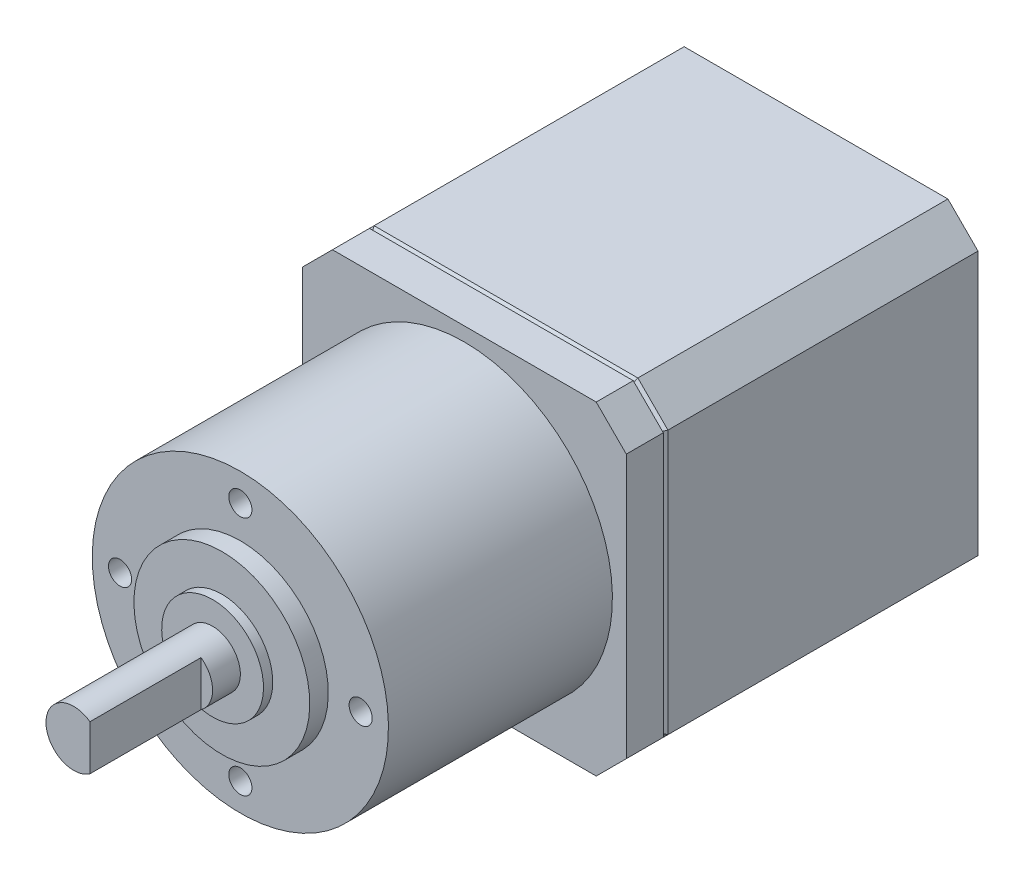
ISO-10303-21;
HEADER;
FILE_DESCRIPTION(('STEP AP214'),'2;1');
FILE_NAME('part.step','',(''),(''),'','','');
FILE_SCHEMA(('AUTOMOTIVE_DESIGN { 1 0 10303 214 1 1 1 1 }'));
ENDSEC;
DATA;
#1=APPLICATION_CONTEXT('core data for automotive mechanical design processes');
#2=APPLICATION_PROTOCOL_DEFINITION('international standard','automotive_design',2000,#1);
#3=PRODUCT_CONTEXT('',#1,'mechanical');
#4=PRODUCT('Part','Part','',(#3));
#5=PRODUCT_RELATED_PRODUCT_CATEGORY('part','',(#4));
#6=PRODUCT_DEFINITION_FORMATION('','',#4);
#7=PRODUCT_DEFINITION_CONTEXT('part definition',#1,'design');
#8=PRODUCT_DEFINITION('design','',#6,#7);
#9=PRODUCT_DEFINITION_SHAPE('','',#8);
#10=(LENGTH_UNIT() NAMED_UNIT(*) SI_UNIT(.MILLI.,.METRE.));
#11=(NAMED_UNIT(*) PLANE_ANGLE_UNIT() SI_UNIT($,.RADIAN.));
#12=(NAMED_UNIT(*) SI_UNIT($,.STERADIAN.) SOLID_ANGLE_UNIT());
#13=UNCERTAINTY_MEASURE_WITH_UNIT(LENGTH_MEASURE(1.E-05),#10,'distance_accuracy_value','');
#14=(GEOMETRIC_REPRESENTATION_CONTEXT(3) GLOBAL_UNCERTAINTY_ASSIGNED_CONTEXT((#13)) GLOBAL_UNIT_ASSIGNED_CONTEXT((#10,
#11,#12)) REPRESENTATION_CONTEXT('',''));
#15=CARTESIAN_POINT('',(0.,0.,0.));
#16=DIRECTION('',(0.,0.,1.));
#17=DIRECTION('',(1.,0.,0.));
#18=AXIS2_PLACEMENT_3D('',#15,#16,#17);
#19=CARTESIAN_POINT('',(17.5,-14.25,38.));
#20=DIRECTION('',(-1.,0.,0.));
#21=DIRECTION('',(0.,0.,1.));
#22=AXIS2_PLACEMENT_3D('',#19,#20,#21);
#23=PLANE('',#22);
#24=DIRECTION('',(0.,1.,0.));
#25=VECTOR('',#24,1.);
#26=CARTESIAN_POINT('',(17.5,-14.25,34.));
#27=LINE('',#26,#25);
#28=CARTESIAN_POINT('',(17.5,-14.25,34.));
#29=VERTEX_POINT('',#28);
#30=CARTESIAN_POINT('',(17.5,14.25,34.));
#31=VERTEX_POINT('',#30);
#32=EDGE_CURVE('E152',#29,#31,#27,.T.);
#33=ORIENTED_EDGE('',*,*,#32,.T.);
#34=DIRECTION('',(0.,0.,-1.));
#35=VECTOR('',#34,1.);
#36=CARTESIAN_POINT('',(17.5,14.25,38.));
#37=LINE('',#36,#35);
#38=CARTESIAN_POINT('',(17.5,14.25,38.));
#39=VERTEX_POINT('',#38);
#40=EDGE_CURVE('E60',#39,#31,#37,.T.);
#41=ORIENTED_EDGE('',*,*,#40,.F.);
#42=DIRECTION('',(0.,1.,0.));
#43=VECTOR('',#42,1.);
#44=CARTESIAN_POINT('',(17.5,-14.25,38.));
#45=LINE('',#44,#43);
#46=CARTESIAN_POINT('',(17.5,-14.25,38.));
#47=VERTEX_POINT('',#46);
#48=EDGE_CURVE('E167',#47,#39,#45,.T.);
#49=ORIENTED_EDGE('',*,*,#48,.F.);
#50=DIRECTION('',(0.,0.,-1.));
#51=VECTOR('',#50,1.);
#52=CARTESIAN_POINT('',(17.5,-14.25,38.));
#53=LINE('',#52,#51);
#54=EDGE_CURVE('E148',#47,#29,#53,.T.);
#55=ORIENTED_EDGE('',*,*,#54,.T.);
#56=EDGE_LOOP('',(#33,#41,#49,#55));
#57=FACE_BOUND('',#56,.T.);
#58=ADVANCED_FACE('F52',(#57),#23,.F.);
#59=CARTESIAN_POINT('',(17.5,14.25,38.));
#60=DIRECTION('',(-0.707106781186547,-0.707106781186547,0.));
#61=DIRECTION('',(0.707106781186548,-0.707106781186548,0.));
#62=AXIS2_PLACEMENT_3D('',#59,#60,#61);
#63=PLANE('',#62);
#64=DIRECTION('',(-0.707106781186547,0.707106781186547,0.));
#65=VECTOR('',#64,1.);
#66=CARTESIAN_POINT('',(17.5,14.25,34.));
#67=LINE('',#66,#65);
#68=CARTESIAN_POINT('',(14.25,17.5,34.));
#69=VERTEX_POINT('',#68);
#70=EDGE_CURVE('E155',#31,#69,#67,.T.);
#71=ORIENTED_EDGE('',*,*,#70,.T.);
#72=DIRECTION('',(0.,0.,-1.));
#73=VECTOR('',#72,1.);
#74=CARTESIAN_POINT('',(14.25,17.5,38.));
#75=LINE('',#74,#73);
#76=CARTESIAN_POINT('',(14.25,17.5,38.));
#77=VERTEX_POINT('',#76);
#78=EDGE_CURVE('E177',#77,#69,#75,.T.);
#79=ORIENTED_EDGE('',*,*,#78,.F.);
#80=DIRECTION('',(-0.707106781186547,0.707106781186547,0.));
#81=VECTOR('',#80,1.);
#82=CARTESIAN_POINT('',(17.5,14.25,38.));
#83=LINE('',#82,#81);
#84=EDGE_CURVE('E113',#39,#77,#83,.T.);
#85=ORIENTED_EDGE('',*,*,#84,.F.);
#86=ORIENTED_EDGE('',*,*,#40,.T.);
#87=EDGE_LOOP('',(#71,#79,#85,#86));
#88=FACE_BOUND('',#87,.T.);
#89=ADVANCED_FACE('F180',(#88),#63,.F.);
#90=CARTESIAN_POINT('',(14.25,17.5,38.));
#91=DIRECTION('',(0.,-1.,0.));
#92=DIRECTION('',(1.,0.,0.));
#93=AXIS2_PLACEMENT_3D('',#90,#91,#92);
#94=PLANE('',#93);
#95=DIRECTION('',(-1.,0.,0.));
#96=VECTOR('',#95,1.);
#97=CARTESIAN_POINT('',(14.25,17.5,34.));
#98=LINE('',#97,#96);
#99=CARTESIAN_POINT('',(-14.25,17.5,34.));
#100=VERTEX_POINT('',#99);
#101=EDGE_CURVE('E158',#69,#100,#98,.T.);
#102=ORIENTED_EDGE('',*,*,#101,.T.);
#103=DIRECTION('',(0.,0.,-1.));
#104=VECTOR('',#103,1.);
#105=CARTESIAN_POINT('',(-14.25,17.5,38.));
#106=LINE('',#105,#104);
#107=CARTESIAN_POINT('',(-14.25,17.5,38.));
#108=VERTEX_POINT('',#107);
#109=EDGE_CURVE('E174',#108,#100,#106,.T.);
#110=ORIENTED_EDGE('',*,*,#109,.F.);
#111=DIRECTION('',(-1.,0.,0.));
#112=VECTOR('',#111,1.);
#113=CARTESIAN_POINT('',(14.25,17.5,38.));
#114=LINE('',#113,#112);
#115=EDGE_CURVE('E198',#77,#108,#114,.T.);
#116=ORIENTED_EDGE('',*,*,#115,.F.);
#117=ORIENTED_EDGE('',*,*,#78,.T.);
#118=EDGE_LOOP('',(#102,#110,#116,#117));
#119=FACE_BOUND('',#118,.T.);
#120=ADVANCED_FACE('F191',(#119),#94,.F.);
#121=CARTESIAN_POINT('',(-14.25,17.5,38.));
#122=DIRECTION('',(0.707106781186547,-0.707106781186547,0.));
#123=DIRECTION('',(0.707106781186548,0.707106781186548,0.));
#124=AXIS2_PLACEMENT_3D('',#121,#122,#123);
#125=PLANE('',#124);
#126=DIRECTION('',(-0.707106781186547,-0.707106781186547,0.));
#127=VECTOR('',#126,1.);
#128=CARTESIAN_POINT('',(-14.25,17.5,34.));
#129=LINE('',#128,#127);
#130=CARTESIAN_POINT('',(-17.5,14.25,34.));
#131=VERTEX_POINT('',#130);
#132=EDGE_CURVE('E160',#100,#131,#129,.T.);
#133=ORIENTED_EDGE('',*,*,#132,.T.);
#134=DIRECTION('',(0.,0.,-1.));
#135=VECTOR('',#134,1.);
#136=CARTESIAN_POINT('',(-17.5,14.25,38.));
#137=LINE('',#136,#135);
#138=CARTESIAN_POINT('',(-17.5,14.25,38.));
#139=VERTEX_POINT('',#138);
#140=EDGE_CURVE('E171',#139,#131,#137,.T.);
#141=ORIENTED_EDGE('',*,*,#140,.F.);
#142=DIRECTION('',(-0.707106781186547,-0.707106781186547,0.));
#143=VECTOR('',#142,1.);
#144=CARTESIAN_POINT('',(-14.25,17.5,38.));
#145=LINE('',#144,#143);
#146=EDGE_CURVE('E197',#108,#139,#145,.T.);
#147=ORIENTED_EDGE('',*,*,#146,.F.);
#148=ORIENTED_EDGE('',*,*,#109,.T.);
#149=EDGE_LOOP('',(#133,#141,#147,#148));
#150=FACE_BOUND('',#149,.T.);
#151=ADVANCED_FACE('F195',(#150),#125,.F.);
#152=CARTESIAN_POINT('',(-17.5,14.25,38.));
#153=DIRECTION('',(1.,0.,0.));
#154=DIRECTION('',(0.,0.,-1.));
#155=AXIS2_PLACEMENT_3D('',#152,#153,#154);
#156=PLANE('',#155);
#157=DIRECTION('',(0.,-1.,0.));
#158=VECTOR('',#157,1.);
#159=CARTESIAN_POINT('',(-17.5,14.25,34.));
#160=LINE('',#159,#158);
#161=CARTESIAN_POINT('',(-17.5,-14.25,34.));
#162=VERTEX_POINT('',#161);
#163=EDGE_CURVE('E162',#131,#162,#160,.T.);
#164=ORIENTED_EDGE('',*,*,#163,.T.);
#165=DIRECTION('',(0.,0.,-1.));
#166=VECTOR('',#165,1.);
#167=CARTESIAN_POINT('',(-17.5,-14.25,38.));
#168=LINE('',#167,#166);
#169=CARTESIAN_POINT('',(-17.5,-14.25,38.));
#170=VERTEX_POINT('',#169);
#171=EDGE_CURVE('E143',#170,#162,#168,.T.);
#172=ORIENTED_EDGE('',*,*,#171,.F.);
#173=DIRECTION('',(0.,-1.,0.));
#174=VECTOR('',#173,1.);
#175=CARTESIAN_POINT('',(-17.5,14.25,38.));
#176=LINE('',#175,#174);
#177=EDGE_CURVE('E134',#139,#170,#176,.T.);
#178=ORIENTED_EDGE('',*,*,#177,.F.);
#179=ORIENTED_EDGE('',*,*,#140,.T.);
#180=EDGE_LOOP('',(#164,#172,#178,#179));
#181=FACE_BOUND('',#180,.T.);
#182=ADVANCED_FACE('F346',(#181),#156,.F.);
#183=CARTESIAN_POINT('',(-17.5,-14.25,38.));
#184=DIRECTION('',(0.707106781186547,0.707106781186547,0.));
#185=DIRECTION('',(-0.707106781186548,0.707106781186548,0.));
#186=AXIS2_PLACEMENT_3D('',#183,#184,#185);
#187=PLANE('',#186);
#188=DIRECTION('',(0.707106781186547,-0.707106781186547,0.));
#189=VECTOR('',#188,1.);
#190=CARTESIAN_POINT('',(-17.5,-14.25,34.));
#191=LINE('',#190,#189);
#192=CARTESIAN_POINT('',(-14.25,-17.5,34.));
#193=VERTEX_POINT('',#192);
#194=EDGE_CURVE('E142',#162,#193,#191,.T.);
#195=ORIENTED_EDGE('',*,*,#194,.T.);
#196=DIRECTION('',(0.,0.,-1.));
#197=VECTOR('',#196,1.);
#198=CARTESIAN_POINT('',(-14.25,-17.5,38.));
#199=LINE('',#198,#197);
#200=CARTESIAN_POINT('',(-14.25,-17.5,38.));
#201=VERTEX_POINT('',#200);
#202=EDGE_CURVE('E139',#201,#193,#199,.T.);
#203=ORIENTED_EDGE('',*,*,#202,.F.);
#204=DIRECTION('',(0.707106781186547,-0.707106781186547,0.));
#205=VECTOR('',#204,1.);
#206=CARTESIAN_POINT('',(-17.5,-14.25,38.));
#207=LINE('',#206,#205);
#208=EDGE_CURVE('E128',#170,#201,#207,.T.);
#209=ORIENTED_EDGE('',*,*,#208,.F.);
#210=ORIENTED_EDGE('',*,*,#171,.T.);
#211=EDGE_LOOP('',(#195,#203,#209,#210));
#212=FACE_BOUND('',#211,.T.);
#213=ADVANCED_FACE('F140',(#212),#187,.F.);
#214=CARTESIAN_POINT('',(-14.25,-17.5,38.));
#215=DIRECTION('',(0.,1.,0.));
#216=DIRECTION('',(-1.,0.,0.));
#217=AXIS2_PLACEMENT_3D('',#214,#215,#216);
#218=PLANE('',#217);
#219=DIRECTION('',(1.,0.,0.));
#220=VECTOR('',#219,1.);
#221=CARTESIAN_POINT('',(-14.25,-17.5,34.));
#222=LINE('',#221,#220);
#223=CARTESIAN_POINT('',(14.25,-17.5,34.));
#224=VERTEX_POINT('',#223);
#225=EDGE_CURVE('E98',#193,#224,#222,.T.);
#226=ORIENTED_EDGE('',*,*,#225,.T.);
#227=DIRECTION('',(0.,0.,-1.));
#228=VECTOR('',#227,1.);
#229=CARTESIAN_POINT('',(14.25,-17.5,38.));
#230=LINE('',#229,#228);
#231=CARTESIAN_POINT('',(14.25,-17.5,38.));
#232=VERTEX_POINT('',#231);
#233=EDGE_CURVE('E144',#232,#224,#230,.T.);
#234=ORIENTED_EDGE('',*,*,#233,.F.);
#235=DIRECTION('',(1.,0.,0.));
#236=VECTOR('',#235,1.);
#237=CARTESIAN_POINT('',(-14.25,-17.5,38.));
#238=LINE('',#237,#236);
#239=EDGE_CURVE('E132',#201,#232,#238,.T.);
#240=ORIENTED_EDGE('',*,*,#239,.F.);
#241=ORIENTED_EDGE('',*,*,#202,.T.);
#242=EDGE_LOOP('',(#226,#234,#240,#241));
#243=FACE_BOUND('',#242,.T.);
#244=ADVANCED_FACE('F146',(#243),#218,.F.);
#245=CARTESIAN_POINT('',(14.25,-17.5,38.));
#246=DIRECTION('',(-0.707106781186547,0.707106781186547,0.));
#247=DIRECTION('',(-0.707106781186548,-0.707106781186548,0.));
#248=AXIS2_PLACEMENT_3D('',#245,#246,#247);
#249=PLANE('',#248);
#250=DIRECTION('',(0.707106781186547,0.707106781186547,0.));
#251=VECTOR('',#250,1.);
#252=CARTESIAN_POINT('',(14.25,-17.5,34.));
#253=LINE('',#252,#251);
#254=EDGE_CURVE('E104',#224,#29,#253,.T.);
#255=ORIENTED_EDGE('',*,*,#254,.T.);
#256=ORIENTED_EDGE('',*,*,#54,.F.);
#257=DIRECTION('',(0.707106781186547,0.707106781186547,0.));
#258=VECTOR('',#257,1.);
#259=CARTESIAN_POINT('',(14.25,-17.5,38.));
#260=LINE('',#259,#258);
#261=EDGE_CURVE('E68',#232,#47,#260,.T.);
#262=ORIENTED_EDGE('',*,*,#261,.F.);
#263=ORIENTED_EDGE('',*,*,#233,.T.);
#264=EDGE_LOOP('',(#255,#256,#262,#263));
#265=FACE_BOUND('',#264,.T.);
#266=ADVANCED_FACE('F326',(#265),#249,.F.);
#267=CARTESIAN_POINT('',(0.,0.,38.));
#268=DIRECTION('',(0.,0.,1.));
#269=DIRECTION('',(1.,0.,0.));
#270=AXIS2_PLACEMENT_3D('',#267,#268,#269);
#271=PLANE('',#270);
#272=CARTESIAN_POINT('',(0.,0.,38.));
#273=DIRECTION('',(0.,0.,-1.));
#274=DIRECTION('',(0.,1.,0.));
#275=AXIS2_PLACEMENT_3D('',#272,#273,#274);
#276=CIRCLE('',#275,16.);
#277=CARTESIAN_POINT('',(0.,16.,38.));
#278=VERTEX_POINT('',#277);
#279=EDGE_CURVE('E224',#278,#278,#276,.T.);
#280=ORIENTED_EDGE('',*,*,#279,.T.);
#281=EDGE_LOOP('',(#280));
#282=FACE_BOUND('',#281,.T.);
#283=ORIENTED_EDGE('',*,*,#48,.T.);
#284=ORIENTED_EDGE('',*,*,#84,.T.);
#285=ORIENTED_EDGE('',*,*,#115,.T.);
#286=ORIENTED_EDGE('',*,*,#146,.T.);
#287=ORIENTED_EDGE('',*,*,#177,.T.);
#288=ORIENTED_EDGE('',*,*,#208,.T.);
#289=ORIENTED_EDGE('',*,*,#239,.T.);
#290=ORIENTED_EDGE('',*,*,#261,.T.);
#291=EDGE_LOOP('',(#283,#284,#285,#286,#287,#288,#289,#290));
#292=FACE_BOUND('',#291,.T.);
#293=ADVANCED_FACE('F130',(#282,#292),#271,.T.);
#294=CARTESIAN_POINT('',(0.,0.,34.));
#295=DIRECTION('',(0.,0.,1.));
#296=DIRECTION('',(1.,0.,0.));
#297=AXIS2_PLACEMENT_3D('',#294,#295,#296);
#298=PLANE('',#297);
#299=ORIENTED_EDGE('',*,*,#32,.F.);
#300=ORIENTED_EDGE('',*,*,#254,.F.);
#301=ORIENTED_EDGE('',*,*,#225,.F.);
#302=ORIENTED_EDGE('',*,*,#194,.F.);
#303=ORIENTED_EDGE('',*,*,#163,.F.);
#304=ORIENTED_EDGE('',*,*,#132,.F.);
#305=ORIENTED_EDGE('',*,*,#101,.F.);
#306=ORIENTED_EDGE('',*,*,#70,.F.);
#307=EDGE_LOOP('',(#299,#300,#301,#302,#303,#304,#305,#306));
#308=FACE_BOUND('',#307,.T.);
#309=ADVANCED_FACE('F185',(#308),#298,.F.);
#310=CARTESIAN_POINT('',(0.,0.,80.2));
#311=DIRECTION('',(0.,0.,1.));
#312=DIRECTION('',(0.,-1.,0.));
#313=AXIS2_PLACEMENT_3D('',#310,#311,#312);
#314=PLANE('',#313);
#315=DIRECTION('',(0.,-1.,0.));
#316=VECTOR('',#315,1.);
#317=CARTESIAN_POINT('',(1.75,2.43669858620224,80.2));
#318=LINE('',#317,#316);
#319=CARTESIAN_POINT('',(1.75,2.43669858620224,80.2));
#320=VERTEX_POINT('',#319);
#321=CARTESIAN_POINT('',(1.75,-2.43669858620226,80.2));
#322=VERTEX_POINT('',#321);
#323=EDGE_CURVE('E258',#320,#322,#318,.T.);
#324=ORIENTED_EDGE('',*,*,#323,.F.);
#325=CARTESIAN_POINT('',(0.,0.,80.2));
#326=DIRECTION('',(0.,0.,-1.));
#327=DIRECTION('',(0.,1.,0.));
#328=AXIS2_PLACEMENT_3D('',#325,#326,#327);
#329=CIRCLE('',#328,3.);
#330=EDGE_CURVE('E156',#322,#320,#329,.T.);
#331=ORIENTED_EDGE('',*,*,#330,.F.);
#332=EDGE_LOOP('',(#324,#331));
#333=FACE_BOUND('',#332,.T.);
#334=ADVANCED_FACE('F284',(#333),#314,.T.);
#335=CARTESIAN_POINT('',(0.,0.,38.));
#336=DIRECTION('',(0.,0.,-1.));
#337=DIRECTION('',(0.,1.,0.));
#338=AXIS2_PLACEMENT_3D('',#335,#336,#337);
#339=CYLINDRICAL_SURFACE('',#338,3.);
#340=DIRECTION('',(0.,0.,1.));
#341=VECTOR('',#340,1.);
#342=CARTESIAN_POINT('',(1.75,2.43669858620224,68.2));
#343=LINE('',#342,#341);
#344=CARTESIAN_POINT('',(1.75,2.43669858620224,68.2));
#345=VERTEX_POINT('',#344);
#346=EDGE_CURVE('E252',#345,#320,#343,.T.);
#347=ORIENTED_EDGE('',*,*,#346,.F.);
#348=CARTESIAN_POINT('',(0.,0.,68.2));
#349=DIRECTION('',(0.,0.,1.));
#350=DIRECTION('',(1.,0.,0.));
#351=AXIS2_PLACEMENT_3D('',#348,#349,#350);
#352=CIRCLE('',#351,3.);
#353=CARTESIAN_POINT('',(1.75,-2.43669858620226,68.2));
#354=VERTEX_POINT('',#353);
#355=EDGE_CURVE('E12',#345,#354,#352,.F.);
#356=ORIENTED_EDGE('',*,*,#355,.T.);
#357=DIRECTION('',(0.,0.,1.));
#358=VECTOR('',#357,1.);
#359=CARTESIAN_POINT('',(1.75,-2.43669858620226,68.2));
#360=LINE('',#359,#358);
#361=EDGE_CURVE('E251',#354,#322,#360,.T.);
#362=ORIENTED_EDGE('',*,*,#361,.T.);
#363=ORIENTED_EDGE('',*,*,#330,.T.);
#364=EDGE_LOOP('',(#347,#356,#362,#363));
#365=FACE_BOUND('',#364,.T.);
#366=CARTESIAN_POINT('',(0.,0.,65.2));
#367=DIRECTION('',(0.,0.,-1.));
#368=DIRECTION('',(0.,1.,0.));
#369=AXIS2_PLACEMENT_3D('',#366,#367,#368);
#370=CIRCLE('',#369,3.);
#371=CARTESIAN_POINT('',(0.,2.99999999999999,65.2));
#372=VERTEX_POINT('',#371);
#373=EDGE_CURVE('E206',#372,#372,#370,.T.);
#374=ORIENTED_EDGE('',*,*,#373,.F.);
#375=EDGE_LOOP('',(#374));
#376=FACE_BOUND('',#375,.T.);
#377=ADVANCED_FACE('F279',(#365,#376),#339,.T.);
#378=CARTESIAN_POINT('',(0.,2.99999999999999,65.2));
#379=DIRECTION('',(0.,0.,1.));
#380=DIRECTION('',(0.,-1.,0.));
#381=AXIS2_PLACEMENT_3D('',#378,#379,#380);
#382=PLANE('',#381);
#383=ORIENTED_EDGE('',*,*,#373,.T.);
#384=EDGE_LOOP('',(#383));
#385=FACE_BOUND('',#384,.T.);
#386=CARTESIAN_POINT('',(0.,0.,65.2));
#387=DIRECTION('',(0.,0.,-1.));
#388=DIRECTION('',(0.,1.,0.));
#389=AXIS2_PLACEMENT_3D('',#386,#387,#388);
#390=CIRCLE('',#389,5.5);
#391=CARTESIAN_POINT('',(0.,5.5,65.2));
#392=VERTEX_POINT('',#391);
#393=EDGE_CURVE('E209',#392,#392,#390,.T.);
#394=ORIENTED_EDGE('',*,*,#393,.F.);
#395=EDGE_LOOP('',(#394));
#396=FACE_BOUND('',#395,.T.);
#397=ADVANCED_FACE('F378',(#385,#396),#382,.T.);
#398=CARTESIAN_POINT('',(0.,0.,38.));
#399=DIRECTION('',(0.,0.,-1.));
#400=DIRECTION('',(0.,1.,0.));
#401=AXIS2_PLACEMENT_3D('',#398,#399,#400);
#402=CYLINDRICAL_SURFACE('',#401,5.5);
#403=ORIENTED_EDGE('',*,*,#393,.T.);
#404=EDGE_LOOP('',(#403));
#405=FACE_BOUND('',#404,.T.);
#406=CARTESIAN_POINT('',(0.,0.,64.2));
#407=DIRECTION('',(0.,0.,-1.));
#408=DIRECTION('',(0.,1.,0.));
#409=AXIS2_PLACEMENT_3D('',#406,#407,#408);
#410=CIRCLE('',#409,5.5);
#411=CARTESIAN_POINT('',(0.,5.5,64.2));
#412=VERTEX_POINT('',#411);
#413=EDGE_CURVE('E212',#412,#412,#410,.T.);
#414=ORIENTED_EDGE('',*,*,#413,.F.);
#415=EDGE_LOOP('',(#414));
#416=FACE_BOUND('',#415,.T.);
#417=ADVANCED_FACE('F383',(#405,#416),#402,.T.);
#418=CARTESIAN_POINT('',(0.,5.5,64.2));
#419=DIRECTION('',(0.,0.,1.));
#420=DIRECTION('',(0.,-1.,0.));
#421=AXIS2_PLACEMENT_3D('',#418,#419,#420);
#422=PLANE('',#421);
#423=ORIENTED_EDGE('',*,*,#413,.T.);
#424=EDGE_LOOP('',(#423));
#425=FACE_BOUND('',#424,.T.);
#426=CARTESIAN_POINT('',(0.,0.,64.2));
#427=DIRECTION('',(0.,0.,-1.));
#428=DIRECTION('',(0.,1.,0.));
#429=AXIS2_PLACEMENT_3D('',#426,#427,#428);
#430=CIRCLE('',#429,9.5);
#431=CARTESIAN_POINT('',(0.,9.5,64.2));
#432=VERTEX_POINT('',#431);
#433=EDGE_CURVE('E215',#432,#432,#430,.T.);
#434=ORIENTED_EDGE('',*,*,#433,.F.);
#435=EDGE_LOOP('',(#434));
#436=FACE_BOUND('',#435,.T.);
#437=ADVANCED_FACE('F395',(#425,#436),#422,.T.);
#438=CARTESIAN_POINT('',(0.,0.,38.));
#439=DIRECTION('',(0.,0.,-1.));
#440=DIRECTION('',(0.,1.,0.));
#441=AXIS2_PLACEMENT_3D('',#438,#439,#440);
#442=CYLINDRICAL_SURFACE('',#441,9.5);
#443=ORIENTED_EDGE('',*,*,#433,.T.);
#444=EDGE_LOOP('',(#443));
#445=FACE_BOUND('',#444,.T.);
#446=CARTESIAN_POINT('',(0.,0.,62.2));
#447=DIRECTION('',(0.,0.,-1.));
#448=DIRECTION('',(0.,1.,0.));
#449=AXIS2_PLACEMENT_3D('',#446,#447,#448);
#450=CIRCLE('',#449,9.5);
#451=CARTESIAN_POINT('',(0.,9.5,62.2));
#452=VERTEX_POINT('',#451);
#453=EDGE_CURVE('E218',#452,#452,#450,.T.);
#454=ORIENTED_EDGE('',*,*,#453,.F.);
#455=EDGE_LOOP('',(#454));
#456=FACE_BOUND('',#455,.T.);
#457=ADVANCED_FACE('F313',(#445,#456),#442,.T.);
#458=CARTESIAN_POINT('',(0.,9.5,62.2));
#459=DIRECTION('',(0.,0.,1.));
#460=DIRECTION('',(0.,-1.,0.));
#461=AXIS2_PLACEMENT_3D('',#458,#459,#460);
#462=PLANE('',#461);
#463=CARTESIAN_POINT('',(0.,13.,62.2));
#464=DIRECTION('',(0.,0.,1.));
#465=DIRECTION('',(1.,0.,0.));
#466=AXIS2_PLACEMENT_3D('',#463,#464,#465);
#467=CIRCLE('',#466,1.25);
#468=CARTESIAN_POINT('',(1.25,13.,62.2));
#469=VERTEX_POINT('',#468);
#470=EDGE_CURVE('E248',#469,#469,#467,.T.);
#471=ORIENTED_EDGE('',*,*,#470,.F.);
#472=EDGE_LOOP('',(#471));
#473=FACE_BOUND('',#472,.T.);
#474=CARTESIAN_POINT('',(13.,0.,62.2));
#475=DIRECTION('',(0.,0.,1.));
#476=DIRECTION('',(1.,0.,0.));
#477=AXIS2_PLACEMENT_3D('',#474,#475,#476);
#478=CIRCLE('',#477,1.25);
#479=CARTESIAN_POINT('',(14.25,0.,62.2));
#480=VERTEX_POINT('',#479);
#481=EDGE_CURVE('E242',#480,#480,#478,.T.);
#482=ORIENTED_EDGE('',*,*,#481,.F.);
#483=EDGE_LOOP('',(#482));
#484=FACE_BOUND('',#483,.T.);
#485=CARTESIAN_POINT('',(0.,-13.,62.2));
#486=DIRECTION('',(0.,0.,1.));
#487=DIRECTION('',(1.,0.,0.));
#488=AXIS2_PLACEMENT_3D('',#485,#486,#487);
#489=CIRCLE('',#488,1.25);
#490=CARTESIAN_POINT('',(1.25,-13.,62.2));
#491=VERTEX_POINT('',#490);
#492=EDGE_CURVE('E236',#491,#491,#489,.T.);
#493=ORIENTED_EDGE('',*,*,#492,.F.);
#494=EDGE_LOOP('',(#493));
#495=FACE_BOUND('',#494,.T.);
#496=CARTESIAN_POINT('',(-13.,0.,62.2));
#497=DIRECTION('',(0.,0.,1.));
#498=DIRECTION('',(1.,0.,0.));
#499=AXIS2_PLACEMENT_3D('',#496,#497,#498);
#500=CIRCLE('',#499,1.25);
#501=CARTESIAN_POINT('',(-11.75,0.,62.2));
#502=VERTEX_POINT('',#501);
#503=EDGE_CURVE('E230',#502,#502,#500,.T.);
#504=ORIENTED_EDGE('',*,*,#503,.F.);
#505=EDGE_LOOP('',(#504));
#506=FACE_BOUND('',#505,.T.);
#507=ORIENTED_EDGE('',*,*,#453,.T.);
#508=EDGE_LOOP('',(#507));
#509=FACE_BOUND('',#508,.T.);
#510=CARTESIAN_POINT('',(0.,0.,62.2));
#511=DIRECTION('',(0.,0.,-1.));
#512=DIRECTION('',(0.,1.,0.));
#513=AXIS2_PLACEMENT_3D('',#510,#511,#512);
#514=CIRCLE('',#513,16.);
#515=CARTESIAN_POINT('',(0.,16.,62.2));
#516=VERTEX_POINT('',#515);
#517=EDGE_CURVE('E221',#516,#516,#514,.T.);
#518=ORIENTED_EDGE('',*,*,#517,.F.);
#519=EDGE_LOOP('',(#518));
#520=FACE_BOUND('',#519,.T.);
#521=ADVANCED_FACE('F310',(#473,#484,#495,#506,#509,#520),#462,.T.);
#522=CARTESIAN_POINT('',(0.,0.,38.));
#523=DIRECTION('',(0.,0.,-1.));
#524=DIRECTION('',(0.,1.,0.));
#525=AXIS2_PLACEMENT_3D('',#522,#523,#524);
#526=CYLINDRICAL_SURFACE('',#525,16.);
#527=ORIENTED_EDGE('',*,*,#517,.T.);
#528=EDGE_LOOP('',(#527));
#529=FACE_BOUND('',#528,.T.);
#530=ORIENTED_EDGE('',*,*,#279,.F.);
#531=EDGE_LOOP('',(#530));
#532=FACE_BOUND('',#531,.T.);
#533=ADVANCED_FACE('F300',(#529,#532),#526,.T.);
#534=CARTESIAN_POINT('',(-13.,0.,57.2));
#535=DIRECTION('',(0.,0.,1.));
#536=DIRECTION('',(1.,0.,0.));
#537=AXIS2_PLACEMENT_3D('',#534,#535,#536);
#538=CONICAL_SURFACE('',#537,1.25,1.02974425867665);
#539=CARTESIAN_POINT('',(-13.,0.,56.4489242262156));
#540=VERTEX_POINT('',#539);
#541=VERTEX_LOOP('',#540);
#542=FACE_BOUND('',#541,.T.);
#543=CARTESIAN_POINT('',(-13.,0.,57.2));
#544=DIRECTION('',(0.,0.,1.));
#545=DIRECTION('',(1.,0.,0.));
#546=AXIS2_PLACEMENT_3D('',#543,#544,#545);
#547=CIRCLE('',#546,1.25);
#548=CARTESIAN_POINT('',(-11.75,0.,57.2));
#549=VERTEX_POINT('',#548);
#550=EDGE_CURVE('E227',#549,#549,#547,.T.);
#551=ORIENTED_EDGE('',*,*,#550,.T.);
#552=EDGE_LOOP('',(#551));
#553=FACE_BOUND('',#552,.T.);
#554=ADVANCED_FACE('F296',(#542,#553),#538,.F.);
#555=CARTESIAN_POINT('',(-13.,0.,62.2));
#556=DIRECTION('',(0.,0.,1.));
#557=DIRECTION('',(1.,0.,0.));
#558=AXIS2_PLACEMENT_3D('',#555,#556,#557);
#559=CYLINDRICAL_SURFACE('',#558,1.25);
#560=ORIENTED_EDGE('',*,*,#550,.F.);
#561=EDGE_LOOP('',(#560));
#562=FACE_BOUND('',#561,.T.);
#563=ORIENTED_EDGE('',*,*,#503,.T.);
#564=EDGE_LOOP('',(#563));
#565=FACE_BOUND('',#564,.T.);
#566=ADVANCED_FACE('F299',(#562,#565),#559,.F.);
#567=CARTESIAN_POINT('',(0.,-13.,57.2));
#568=DIRECTION('',(0.,0.,1.));
#569=DIRECTION('',(1.,0.,0.));
#570=AXIS2_PLACEMENT_3D('',#567,#568,#569);
#571=CONICAL_SURFACE('',#570,1.25,1.02974425867665);
#572=CARTESIAN_POINT('',(0.,-13.,56.4489242262156));
#573=VERTEX_POINT('',#572);
#574=VERTEX_LOOP('',#573);
#575=FACE_BOUND('',#574,.T.);
#576=CARTESIAN_POINT('',(0.,-13.,57.2));
#577=DIRECTION('',(0.,0.,1.));
#578=DIRECTION('',(1.,0.,0.));
#579=AXIS2_PLACEMENT_3D('',#576,#577,#578);
#580=CIRCLE('',#579,1.25);
#581=CARTESIAN_POINT('',(1.25,-13.,57.2));
#582=VERTEX_POINT('',#581);
#583=EDGE_CURVE('E233',#582,#582,#580,.T.);
#584=ORIENTED_EDGE('',*,*,#583,.T.);
#585=EDGE_LOOP('',(#584));
#586=FACE_BOUND('',#585,.T.);
#587=ADVANCED_FACE('F306',(#575,#586),#571,.F.);
#588=CARTESIAN_POINT('',(0.,-13.,62.2));
#589=DIRECTION('',(0.,0.,1.));
#590=DIRECTION('',(1.,0.,0.));
#591=AXIS2_PLACEMENT_3D('',#588,#589,#590);
#592=CYLINDRICAL_SURFACE('',#591,1.25);
#593=ORIENTED_EDGE('',*,*,#583,.F.);
#594=EDGE_LOOP('',(#593));
#595=FACE_BOUND('',#594,.T.);
#596=ORIENTED_EDGE('',*,*,#492,.T.);
#597=EDGE_LOOP('',(#596));
#598=FACE_BOUND('',#597,.T.);
#599=ADVANCED_FACE('F452',(#595,#598),#592,.F.);
#600=CARTESIAN_POINT('',(13.,0.,57.2));
#601=DIRECTION('',(0.,0.,1.));
#602=DIRECTION('',(1.,0.,0.));
#603=AXIS2_PLACEMENT_3D('',#600,#601,#602);
#604=CONICAL_SURFACE('',#603,1.25,1.02974425867665);
#605=CARTESIAN_POINT('',(13.,0.,56.4489242262156));
#606=VERTEX_POINT('',#605);
#607=VERTEX_LOOP('',#606);
#608=FACE_BOUND('',#607,.T.);
#609=CARTESIAN_POINT('',(13.,0.,57.2));
#610=DIRECTION('',(0.,0.,1.));
#611=DIRECTION('',(1.,0.,0.));
#612=AXIS2_PLACEMENT_3D('',#609,#610,#611);
#613=CIRCLE('',#612,1.25);
#614=CARTESIAN_POINT('',(14.25,0.,57.2));
#615=VERTEX_POINT('',#614);
#616=EDGE_CURVE('E239',#615,#615,#613,.T.);
#617=ORIENTED_EDGE('',*,*,#616,.T.);
#618=EDGE_LOOP('',(#617));
#619=FACE_BOUND('',#618,.T.);
#620=ADVANCED_FACE('F461',(#608,#619),#604,.F.);
#621=CARTESIAN_POINT('',(13.,0.,62.2));
#622=DIRECTION('',(0.,0.,1.));
#623=DIRECTION('',(1.,0.,0.));
#624=AXIS2_PLACEMENT_3D('',#621,#622,#623);
#625=CYLINDRICAL_SURFACE('',#624,1.25);
#626=ORIENTED_EDGE('',*,*,#616,.F.);
#627=EDGE_LOOP('',(#626));
#628=FACE_BOUND('',#627,.T.);
#629=ORIENTED_EDGE('',*,*,#481,.T.);
#630=EDGE_LOOP('',(#629));
#631=FACE_BOUND('',#630,.T.);
#632=ADVANCED_FACE('F473',(#628,#631),#625,.F.);
#633=CARTESIAN_POINT('',(0.,13.,57.2));
#634=DIRECTION('',(0.,0.,1.));
#635=DIRECTION('',(1.,0.,0.));
#636=AXIS2_PLACEMENT_3D('',#633,#634,#635);
#637=CONICAL_SURFACE('',#636,1.25,1.02974425867665);
#638=CARTESIAN_POINT('',(0.,13.,56.4489242262156));
#639=VERTEX_POINT('',#638);
#640=VERTEX_LOOP('',#639);
#641=FACE_BOUND('',#640,.T.);
#642=CARTESIAN_POINT('',(0.,13.,57.2));
#643=DIRECTION('',(0.,0.,1.));
#644=DIRECTION('',(1.,0.,0.));
#645=AXIS2_PLACEMENT_3D('',#642,#643,#644);
#646=CIRCLE('',#645,1.25);
#647=CARTESIAN_POINT('',(1.25,13.,57.2));
#648=VERTEX_POINT('',#647);
#649=EDGE_CURVE('E245',#648,#648,#646,.T.);
#650=ORIENTED_EDGE('',*,*,#649,.T.);
#651=EDGE_LOOP('',(#650));
#652=FACE_BOUND('',#651,.T.);
#653=ADVANCED_FACE('F483',(#641,#652),#637,.F.);
#654=CARTESIAN_POINT('',(0.,13.,62.2));
#655=DIRECTION('',(0.,0.,1.));
#656=DIRECTION('',(1.,0.,0.));
#657=AXIS2_PLACEMENT_3D('',#654,#655,#656);
#658=CYLINDRICAL_SURFACE('',#657,1.25);
#659=ORIENTED_EDGE('',*,*,#649,.F.);
#660=EDGE_LOOP('',(#659));
#661=FACE_BOUND('',#660,.T.);
#662=ORIENTED_EDGE('',*,*,#470,.T.);
#663=EDGE_LOOP('',(#662));
#664=FACE_BOUND('',#663,.T.);
#665=ADVANCED_FACE('F495',(#661,#664),#658,.F.);
#666=CARTESIAN_POINT('',(1.75,2.43669858620224,68.2));
#667=DIRECTION('',(-1.,0.,0.));
#668=DIRECTION('',(0.,0.,1.));
#669=AXIS2_PLACEMENT_3D('',#666,#667,#668);
#670=PLANE('',#669);
#671=ORIENTED_EDGE('',*,*,#323,.T.);
#672=ORIENTED_EDGE('',*,*,#361,.F.);
#673=DIRECTION('',(0.,-1.,0.));
#674=VECTOR('',#673,1.);
#675=CARTESIAN_POINT('',(1.75,2.43669858620224,68.2));
#676=LINE('',#675,#674);
#677=EDGE_CURVE('E255',#345,#354,#676,.T.);
#678=ORIENTED_EDGE('',*,*,#677,.F.);
#679=ORIENTED_EDGE('',*,*,#346,.T.);
#680=EDGE_LOOP('',(#671,#672,#678,#679));
#681=FACE_BOUND('',#680,.T.);
#682=ADVANCED_FACE('F273',(#681),#670,.F.);
#683=CARTESIAN_POINT('',(0.,0.,68.2));
#684=DIRECTION('',(0.,0.,1.));
#685=DIRECTION('',(1.,0.,0.));
#686=AXIS2_PLACEMENT_3D('',#683,#684,#685);
#687=PLANE('',#686);
#688=ORIENTED_EDGE('',*,*,#355,.F.);
#689=ORIENTED_EDGE('',*,*,#677,.T.);
#690=EDGE_LOOP('',(#688,#689));
#691=FACE_BOUND('',#690,.T.);
#692=ADVANCED_FACE('F266',(#691),#687,.T.);
#693=CLOSED_SHELL('',(#58,#89,#120,#151,#182,#213,#244,#266,#293,#309,#334,#377,#397,#417,#437,
#457,#521,#533,#554,#566,#587,#599,#620,#632,#653,#665,#682,#692));
#694=MANIFOLD_SOLID_BREP('B2',#693);
#695=CARTESIAN_POINT('',(17.5,14.25,34.));
#696=DIRECTION('',(-0.707106781186548,-0.707106781186548,0.));
#697=DIRECTION('',(0.707106781186548,-0.707106781186548,0.));
#698=AXIS2_PLACEMENT_3D('',#695,#696,#697);
#699=PLANE('',#698);
#700=DIRECTION('',(0.,0.,-1.));
#701=VECTOR('',#700,1.);
#702=CARTESIAN_POINT('',(14.25,17.5,34.));
#703=LINE('',#702,#701);
#704=CARTESIAN_POINT('',(14.25,17.5,33.5));
#705=VERTEX_POINT('',#704);
#706=CARTESIAN_POINT('',(14.25,17.5,0.));
#707=VERTEX_POINT('',#706);
#708=EDGE_CURVE('E725',#705,#707,#703,.T.);
#709=ORIENTED_EDGE('',*,*,#708,.F.);
#710=DIRECTION('',(0.707106781186548,-0.707106781186548,0.));
#711=VECTOR('',#710,1.);
#712=CARTESIAN_POINT('',(17.5,14.25,33.5));
#713=LINE('',#712,#711);
#714=CARTESIAN_POINT('',(17.5,14.25,33.5));
#715=VERTEX_POINT('',#714);
#716=EDGE_CURVE('E50',#705,#715,#713,.T.);
#717=ORIENTED_EDGE('',*,*,#716,.T.);
#718=DIRECTION('',(0.,0.,-1.));
#719=VECTOR('',#718,1.);
#720=CARTESIAN_POINT('',(17.5,14.25,34.));
#721=LINE('',#720,#719);
#722=CARTESIAN_POINT('',(17.5,14.25,0.));
#723=VERTEX_POINT('',#722);
#724=EDGE_CURVE('E746',#715,#723,#721,.T.);
#725=ORIENTED_EDGE('',*,*,#724,.T.);
#726=DIRECTION('',(-0.707106781186547,0.707106781186547,0.));
#727=VECTOR('',#726,1.);
#728=CARTESIAN_POINT('',(17.5,14.25,0.));
#729=LINE('',#728,#727);
#730=EDGE_CURVE('E741',#723,#707,#729,.T.);
#731=ORIENTED_EDGE('',*,*,#730,.T.);
#732=EDGE_LOOP('',(#709,#717,#725,#731));
#733=FACE_BOUND('',#732,.T.);
#734=ADVANCED_FACE('F636',(#733),#699,.F.);
#735=CARTESIAN_POINT('',(14.25,17.5,34.));
#736=DIRECTION('',(0.,-1.,0.));
#737=DIRECTION('',(1.,0.,0.));
#738=AXIS2_PLACEMENT_3D('',#735,#736,#737);
#739=PLANE('',#738);
#740=DIRECTION('',(0.,0.,-1.));
#741=VECTOR('',#740,1.);
#742=CARTESIAN_POINT('',(-14.25,17.5,34.));
#743=LINE('',#742,#741);
#744=CARTESIAN_POINT('',(-14.25,17.5,33.5));
#745=VERTEX_POINT('',#744);
#746=CARTESIAN_POINT('',(-14.25,17.5,0.));
#747=VERTEX_POINT('',#746);
#748=EDGE_CURVE('E735',#745,#747,#743,.T.);
#749=ORIENTED_EDGE('',*,*,#748,.F.);
#750=DIRECTION('',(1.,0.,0.));
#751=VECTOR('',#750,1.);
#752=CARTESIAN_POINT('',(14.25,17.5,33.5));
#753=LINE('',#752,#751);
#754=EDGE_CURVE('E732',#745,#705,#753,.T.);
#755=ORIENTED_EDGE('',*,*,#754,.T.);
#756=ORIENTED_EDGE('',*,*,#708,.T.);
#757=DIRECTION('',(-1.,0.,0.));
#758=VECTOR('',#757,1.);
#759=CARTESIAN_POINT('',(14.25,17.5,0.));
#760=LINE('',#759,#758);
#761=EDGE_CURVE('E729',#707,#747,#760,.T.);
#762=ORIENTED_EDGE('',*,*,#761,.T.);
#763=EDGE_LOOP('',(#749,#755,#756,#762));
#764=FACE_BOUND('',#763,.T.);
#765=ADVANCED_FACE('F728',(#764),#739,.F.);
#766=CARTESIAN_POINT('',(-14.25,17.5,34.));
#767=DIRECTION('',(0.707106781186548,-0.707106781186548,0.));
#768=DIRECTION('',(0.707106781186548,0.707106781186548,0.));
#769=AXIS2_PLACEMENT_3D('',#766,#767,#768);
#770=PLANE('',#769);
#771=DIRECTION('',(0.,0.,-1.));
#772=VECTOR('',#771,1.);
#773=CARTESIAN_POINT('',(-17.5,14.25,34.));
#774=LINE('',#773,#772);
#775=CARTESIAN_POINT('',(-17.5,14.25,33.5));
#776=VERTEX_POINT('',#775);
#777=CARTESIAN_POINT('',(-17.5,14.25,0.));
#778=VERTEX_POINT('',#777);
#779=EDGE_CURVE('E776',#776,#778,#774,.T.);
#780=ORIENTED_EDGE('',*,*,#779,.F.);
#781=DIRECTION('',(0.707106781186548,0.707106781186548,0.));
#782=VECTOR('',#781,1.);
#783=CARTESIAN_POINT('',(-14.25,17.5,33.5));
#784=LINE('',#783,#782);
#785=EDGE_CURVE('E796',#776,#745,#784,.T.);
#786=ORIENTED_EDGE('',*,*,#785,.T.);
#787=ORIENTED_EDGE('',*,*,#748,.T.);
#788=DIRECTION('',(-0.707106781186547,-0.707106781186547,0.));
#789=VECTOR('',#788,1.);
#790=CARTESIAN_POINT('',(-14.25,17.5,0.));
#791=LINE('',#790,#789);
#792=EDGE_CURVE('E744',#747,#778,#791,.T.);
#793=ORIENTED_EDGE('',*,*,#792,.T.);
#794=EDGE_LOOP('',(#780,#786,#787,#793));
#795=FACE_BOUND('',#794,.T.);
#796=ADVANCED_FACE('F849',(#795),#770,.F.);
#797=CARTESIAN_POINT('',(-17.5,-14.25,34.));
#798=DIRECTION('',(1.,0.,0.));
#799=DIRECTION('',(0.,0.,-1.));
#800=AXIS2_PLACEMENT_3D('',#797,#798,#799);
#801=PLANE('',#800);
#802=DIRECTION('',(0.,0.,-1.));
#803=VECTOR('',#802,1.);
#804=CARTESIAN_POINT('',(-17.5,-14.25,34.));
#805=LINE('',#804,#803);
#806=CARTESIAN_POINT('',(-17.5,-14.25,33.5));
#807=VERTEX_POINT('',#806);
#808=CARTESIAN_POINT('',(-17.5,-14.25,0.));
#809=VERTEX_POINT('',#808);
#810=EDGE_CURVE('E774',#807,#809,#805,.T.);
#811=ORIENTED_EDGE('',*,*,#810,.F.);
#812=DIRECTION('',(0.,1.,0.));
#813=VECTOR('',#812,1.);
#814=CARTESIAN_POINT('',(-17.5,14.25,33.5));
#815=LINE('',#814,#813);
#816=EDGE_CURVE('E798',#807,#776,#815,.T.);
#817=ORIENTED_EDGE('',*,*,#816,.T.);
#818=ORIENTED_EDGE('',*,*,#779,.T.);
#819=DIRECTION('',(0.,-1.,0.));
#820=VECTOR('',#819,1.);
#821=CARTESIAN_POINT('',(-17.5,-14.25,0.));
#822=LINE('',#821,#820);
#823=EDGE_CURVE('E753',#778,#809,#822,.T.);
#824=ORIENTED_EDGE('',*,*,#823,.T.);
#825=EDGE_LOOP('',(#811,#817,#818,#824));
#826=FACE_BOUND('',#825,.T.);
#827=ADVANCED_FACE('F989',(#826),#801,.F.);
#828=CARTESIAN_POINT('',(-14.25,-17.5,34.));
#829=DIRECTION('',(0.707106781186548,0.707106781186548,0.));
#830=DIRECTION('',(-0.707106781186548,0.707106781186548,0.));
#831=AXIS2_PLACEMENT_3D('',#828,#829,#830);
#832=PLANE('',#831);
#833=DIRECTION('',(0.,0.,-1.));
#834=VECTOR('',#833,1.);
#835=CARTESIAN_POINT('',(-14.25,-17.5,34.));
#836=LINE('',#835,#834);
#837=CARTESIAN_POINT('',(-14.25,-17.5,33.5));
#838=VERTEX_POINT('',#837);
#839=CARTESIAN_POINT('',(-14.25,-17.5,0.));
#840=VERTEX_POINT('',#839);
#841=EDGE_CURVE('E772',#838,#840,#836,.T.);
#842=ORIENTED_EDGE('',*,*,#841,.F.);
#843=DIRECTION('',(-0.707106781186548,0.707106781186548,0.));
#844=VECTOR('',#843,1.);
#845=CARTESIAN_POINT('',(-17.5,-14.25,33.5));
#846=LINE('',#845,#844);
#847=EDGE_CURVE('E800',#838,#807,#846,.T.);
#848=ORIENTED_EDGE('',*,*,#847,.T.);
#849=ORIENTED_EDGE('',*,*,#810,.T.);
#850=DIRECTION('',(0.707106781186547,-0.707106781186547,0.));
#851=VECTOR('',#850,1.);
#852=CARTESIAN_POINT('',(-14.25,-17.5,0.));
#853=LINE('',#852,#851);
#854=EDGE_CURVE('E756',#809,#840,#853,.T.);
#855=ORIENTED_EDGE('',*,*,#854,.T.);
#856=EDGE_LOOP('',(#842,#848,#849,#855));
#857=FACE_BOUND('',#856,.T.);
#858=ADVANCED_FACE('F980',(#857),#832,.F.);
#859=CARTESIAN_POINT('',(14.25,-17.5,34.));
#860=DIRECTION('',(0.,1.,0.));
#861=DIRECTION('',(-1.,0.,0.));
#862=AXIS2_PLACEMENT_3D('',#859,#860,#861);
#863=PLANE('',#862);
#864=DIRECTION('',(0.,0.,-1.));
#865=VECTOR('',#864,1.);
#866=CARTESIAN_POINT('',(14.25,-17.5,34.));
#867=LINE('',#866,#865);
#868=CARTESIAN_POINT('',(14.25,-17.5,33.5));
#869=VERTEX_POINT('',#868);
#870=CARTESIAN_POINT('',(14.25,-17.5,0.));
#871=VERTEX_POINT('',#870);
#872=EDGE_CURVE('E770',#869,#871,#867,.T.);
#873=ORIENTED_EDGE('',*,*,#872,.F.);
#874=DIRECTION('',(-1.,0.,0.));
#875=VECTOR('',#874,1.);
#876=CARTESIAN_POINT('',(-14.25,-17.5,33.5));
#877=LINE('',#876,#875);
#878=EDGE_CURVE('E802',#869,#838,#877,.T.);
#879=ORIENTED_EDGE('',*,*,#878,.T.);
#880=ORIENTED_EDGE('',*,*,#841,.T.);
#881=DIRECTION('',(1.,0.,0.));
#882=VECTOR('',#881,1.);
#883=CARTESIAN_POINT('',(14.25,-17.5,0.));
#884=LINE('',#883,#882);
#885=EDGE_CURVE('E759',#840,#871,#884,.T.);
#886=ORIENTED_EDGE('',*,*,#885,.T.);
#887=EDGE_LOOP('',(#873,#879,#880,#886));
#888=FACE_BOUND('',#887,.T.);
#889=ADVANCED_FACE('F868',(#888),#863,.F.);
#890=CARTESIAN_POINT('',(17.5,-14.25,34.));
#891=DIRECTION('',(-0.707106781186548,0.707106781186548,0.));
#892=DIRECTION('',(-0.707106781186548,-0.707106781186548,0.));
#893=AXIS2_PLACEMENT_3D('',#890,#891,#892);
#894=PLANE('',#893);
#895=DIRECTION('',(0.,0.,-1.));
#896=VECTOR('',#895,1.);
#897=CARTESIAN_POINT('',(17.5,-14.25,34.));
#898=LINE('',#897,#896);
#899=CARTESIAN_POINT('',(17.5,-14.25,33.5));
#900=VERTEX_POINT('',#899);
#901=CARTESIAN_POINT('',(17.5,-14.25,0.));
#902=VERTEX_POINT('',#901);
#903=EDGE_CURVE('E768',#900,#902,#898,.T.);
#904=ORIENTED_EDGE('',*,*,#903,.F.);
#905=DIRECTION('',(-0.707106781186548,-0.707106781186548,0.));
#906=VECTOR('',#905,1.);
#907=CARTESIAN_POINT('',(14.25,-17.5,33.5));
#908=LINE('',#907,#906);
#909=EDGE_CURVE('E804',#900,#869,#908,.T.);
#910=ORIENTED_EDGE('',*,*,#909,.T.);
#911=ORIENTED_EDGE('',*,*,#872,.T.);
#912=DIRECTION('',(0.707106781186547,0.707106781186547,0.));
#913=VECTOR('',#912,1.);
#914=CARTESIAN_POINT('',(17.5,-14.25,0.));
#915=LINE('',#914,#913);
#916=EDGE_CURVE('E762',#871,#902,#915,.T.);
#917=ORIENTED_EDGE('',*,*,#916,.T.);
#918=EDGE_LOOP('',(#904,#910,#911,#917));
#919=FACE_BOUND('',#918,.T.);
#920=ADVANCED_FACE('F866',(#919),#894,.F.);
#921=CARTESIAN_POINT('',(17.5,-14.25,34.));
#922=DIRECTION('',(-1.,0.,0.));
#923=DIRECTION('',(0.,0.,1.));
#924=AXIS2_PLACEMENT_3D('',#921,#922,#923);
#925=PLANE('',#924);
#926=ORIENTED_EDGE('',*,*,#724,.F.);
#927=DIRECTION('',(0.,-1.,0.));
#928=VECTOR('',#927,1.);
#929=CARTESIAN_POINT('',(17.5,-14.25,33.5));
#930=LINE('',#929,#928);
#931=EDGE_CURVE('E645',#715,#900,#930,.T.);
#932=ORIENTED_EDGE('',*,*,#931,.T.);
#933=ORIENTED_EDGE('',*,*,#903,.T.);
#934=DIRECTION('',(0.,1.,0.));
#935=VECTOR('',#934,1.);
#936=CARTESIAN_POINT('',(17.5,-14.25,0.));
#937=LINE('',#936,#935);
#938=EDGE_CURVE('E765',#902,#723,#937,.T.);
#939=ORIENTED_EDGE('',*,*,#938,.T.);
#940=EDGE_LOOP('',(#926,#932,#933,#939));
#941=FACE_BOUND('',#940,.T.);
#942=ADVANCED_FACE('F873',(#941),#925,.F.);
#943=CARTESIAN_POINT('',(0.,0.,34.));
#944=DIRECTION('',(0.,0.,1.));
#945=DIRECTION('',(1.,0.,0.));
#946=AXIS2_PLACEMENT_3D('',#943,#944,#945);
#947=PLANE('',#946);
#948=DIRECTION('',(-0.707106781186548,0.707106781186548,0.));
#949=VECTOR('',#948,1.);
#950=CARTESIAN_POINT('',(13.8964466094067,17.1464466094067,34.));
#951=LINE('',#950,#949);
#952=CARTESIAN_POINT('',(17.,14.0428932188135,34.));
#953=VERTEX_POINT('',#952);
#954=CARTESIAN_POINT('',(14.0428932188135,17.,34.));
#955=VERTEX_POINT('',#954);
#956=EDGE_CURVE('E734',#953,#955,#951,.T.);
#957=ORIENTED_EDGE('',*,*,#956,.T.);
#958=DIRECTION('',(-1.,0.,0.));
#959=VECTOR('',#958,1.);
#960=CARTESIAN_POINT('',(-14.25,17.,34.));
#961=LINE('',#960,#959);
#962=CARTESIAN_POINT('',(-14.0428932188135,17.,34.));
#963=VERTEX_POINT('',#962);
#964=EDGE_CURVE('E792',#955,#963,#961,.T.);
#965=ORIENTED_EDGE('',*,*,#964,.T.);
#966=DIRECTION('',(-0.707106781186548,-0.707106781186548,0.));
#967=VECTOR('',#966,1.);
#968=CARTESIAN_POINT('',(-17.1464466094067,13.8964466094067,34.));
#969=LINE('',#968,#967);
#970=CARTESIAN_POINT('',(-17.,14.0428932188135,34.));
#971=VERTEX_POINT('',#970);
#972=EDGE_CURVE('E790',#963,#971,#969,.T.);
#973=ORIENTED_EDGE('',*,*,#972,.T.);
#974=DIRECTION('',(0.,-1.,0.));
#975=VECTOR('',#974,1.);
#976=CARTESIAN_POINT('',(-17.,-14.25,34.));
#977=LINE('',#976,#975);
#978=CARTESIAN_POINT('',(-17.,-14.0428932188135,34.));
#979=VERTEX_POINT('',#978);
#980=EDGE_CURVE('E788',#971,#979,#977,.T.);
#981=ORIENTED_EDGE('',*,*,#980,.T.);
#982=DIRECTION('',(0.707106781186548,-0.707106781186548,0.));
#983=VECTOR('',#982,1.);
#984=CARTESIAN_POINT('',(-13.8964466094067,-17.1464466094067,34.));
#985=LINE('',#984,#983);
#986=CARTESIAN_POINT('',(-14.0428932188135,-17.,34.));
#987=VERTEX_POINT('',#986);
#988=EDGE_CURVE('E786',#979,#987,#985,.T.);
#989=ORIENTED_EDGE('',*,*,#988,.T.);
#990=DIRECTION('',(1.,0.,0.));
#991=VECTOR('',#990,1.);
#992=CARTESIAN_POINT('',(14.25,-17.,34.));
#993=LINE('',#992,#991);
#994=CARTESIAN_POINT('',(14.0428932188135,-17.,34.));
#995=VERTEX_POINT('',#994);
#996=EDGE_CURVE('E784',#987,#995,#993,.T.);
#997=ORIENTED_EDGE('',*,*,#996,.T.);
#998=DIRECTION('',(0.707106781186548,0.707106781186548,0.));
#999=VECTOR('',#998,1.);
#1000=CARTESIAN_POINT('',(17.1464466094067,-13.8964466094067,34.));
#1001=LINE('',#1000,#999);
#1002=CARTESIAN_POINT('',(17.,-14.0428932188134,34.));
#1003=VERTEX_POINT('',#1002);
#1004=EDGE_CURVE('E782',#995,#1003,#1001,.T.);
#1005=ORIENTED_EDGE('',*,*,#1004,.T.);
#1006=DIRECTION('',(0.,1.,0.));
#1007=VECTOR('',#1006,1.);
#1008=CARTESIAN_POINT('',(17.,14.25,34.));
#1009=LINE('',#1008,#1007);
#1010=EDGE_CURVE('E780',#1003,#953,#1009,.T.);
#1011=ORIENTED_EDGE('',*,*,#1010,.T.);
#1012=EDGE_LOOP('',(#957,#965,#973,#981,#989,#997,#1005,#1011));
#1013=FACE_BOUND('',#1012,.T.);
#1014=ADVANCED_FACE('F835',(#1013),#947,.T.);
#1015=CARTESIAN_POINT('',(0.,0.,0.));
#1016=DIRECTION('',(0.,0.,1.));
#1017=DIRECTION('',(1.,0.,0.));
#1018=AXIS2_PLACEMENT_3D('',#1015,#1016,#1017);
#1019=PLANE('',#1018);
#1020=ORIENTED_EDGE('',*,*,#730,.F.);
#1021=ORIENTED_EDGE('',*,*,#938,.F.);
#1022=ORIENTED_EDGE('',*,*,#916,.F.);
#1023=ORIENTED_EDGE('',*,*,#885,.F.);
#1024=ORIENTED_EDGE('',*,*,#854,.F.);
#1025=ORIENTED_EDGE('',*,*,#823,.F.);
#1026=ORIENTED_EDGE('',*,*,#792,.F.);
#1027=ORIENTED_EDGE('',*,*,#761,.F.);
#1028=EDGE_LOOP('',(#1020,#1021,#1022,#1023,#1024,#1025,#1026,#1027));
#1029=FACE_BOUND('',#1028,.T.);
#1030=ADVANCED_FACE('F739',(#1029),#1019,.F.);
#1031=CARTESIAN_POINT('',(0.,-17.,34.));
#1032=DIRECTION('',(0.,-0.70710678118654,0.707106781186555));
#1033=DIRECTION('',(-1.,0.,0.));
#1034=AXIS2_PLACEMENT_3D('',#1031,#1032,#1033);
#1035=PLANE('',#1034);
#1036=DIRECTION('',(-0.281084637714817,-0.678598344545855,-0.678598344545841));
#1037=VECTOR('',#1036,1.);
#1038=CARTESIAN_POINT('',(-12.9333842569499,-14.3214084166943,36.6785915833056));
#1039=LINE('',#1038,#1037);
#1040=EDGE_CURVE('E750',#838,#987,#1039,.F.);
#1041=ORIENTED_EDGE('',*,*,#1040,.F.);
#1042=ORIENTED_EDGE('',*,*,#878,.F.);
#1043=DIRECTION('',(0.281084637714822,-0.678598344545854,-0.67859834454584));
#1044=VECTOR('',#1043,1.);
#1045=CARTESIAN_POINT('',(13.8776870612286,-16.6011570537712,34.3988429462288));
#1046=LINE('',#1045,#1044);
#1047=EDGE_CURVE('E640',#995,#869,#1046,.T.);
#1048=ORIENTED_EDGE('',*,*,#1047,.F.);
#1049=ORIENTED_EDGE('',*,*,#996,.F.);
#1050=EDGE_LOOP('',(#1041,#1042,#1048,#1049));
#1051=FACE_BOUND('',#1050,.T.);
#1052=ADVANCED_FACE('F638',(#1051),#1035,.T.);
#1053=CARTESIAN_POINT('',(15.5214466094067,-15.5214466094067,34.));
#1054=DIRECTION('',(0.499999999999995,-0.499999999999995,0.707106781186554));
#1055=DIRECTION('',(-0.707106781186548,-0.707106781186548,0.));
#1056=AXIS2_PLACEMENT_3D('',#1053,#1054,#1055);
#1057=PLANE('',#1056);
#1058=ORIENTED_EDGE('',*,*,#1047,.T.);
#1059=ORIENTED_EDGE('',*,*,#909,.F.);
#1060=DIRECTION('',(0.678598344545854,-0.281084637714822,-0.67859834454584));
#1061=VECTOR('',#1060,1.);
#1062=CARTESIAN_POINT('',(14.3214084166943,-12.9333842569498,36.6785915833056));
#1063=LINE('',#1062,#1061);
#1064=EDGE_CURVE('E820',#1003,#900,#1063,.T.);
#1065=ORIENTED_EDGE('',*,*,#1064,.F.);
#1066=ORIENTED_EDGE('',*,*,#1004,.F.);
#1067=EDGE_LOOP('',(#1058,#1059,#1065,#1066));
#1068=FACE_BOUND('',#1067,.T.);
#1069=ADVANCED_FACE('F863',(#1068),#1057,.T.);
#1070=CARTESIAN_POINT('',(-15.5214466094067,-15.5214466094067,34.));
#1071=DIRECTION('',(-0.499999999999996,-0.499999999999996,0.707106781186553));
#1072=DIRECTION('',(-0.707106781186548,0.707106781186548,0.));
#1073=AXIS2_PLACEMENT_3D('',#1070,#1071,#1072);
#1074=PLANE('',#1073);
#1075=ORIENTED_EDGE('',*,*,#1040,.T.);
#1076=ORIENTED_EDGE('',*,*,#988,.F.);
#1077=DIRECTION('',(-0.678598344545855,-0.281084637714817,-0.678598344545841));
#1078=VECTOR('',#1077,1.);
#1079=CARTESIAN_POINT('',(-16.6011570537712,-13.8776870612286,34.3988429462288));
#1080=LINE('',#1079,#1078);
#1081=EDGE_CURVE('E817',#807,#979,#1080,.F.);
#1082=ORIENTED_EDGE('',*,*,#1081,.F.);
#1083=ORIENTED_EDGE('',*,*,#847,.F.);
#1084=EDGE_LOOP('',(#1075,#1076,#1082,#1083));
#1085=FACE_BOUND('',#1084,.T.);
#1086=ADVANCED_FACE('F827',(#1085),#1074,.T.);
#1087=CARTESIAN_POINT('',(17.,0.,34.));
#1088=DIRECTION('',(0.70710678118654,0.,0.707106781186555));
#1089=DIRECTION('',(0.,-1.,0.));
#1090=AXIS2_PLACEMENT_3D('',#1087,#1088,#1089);
#1091=PLANE('',#1090);
#1092=ORIENTED_EDGE('',*,*,#1064,.T.);
#1093=ORIENTED_EDGE('',*,*,#931,.F.);
#1094=DIRECTION('',(0.678598344545854,0.281084637714822,-0.67859834454584));
#1095=VECTOR('',#1094,1.);
#1096=CARTESIAN_POINT('',(16.6011570537712,13.8776870612286,34.3988429462288));
#1097=LINE('',#1096,#1095);
#1098=EDGE_CURVE('E814',#953,#715,#1097,.T.);
#1099=ORIENTED_EDGE('',*,*,#1098,.F.);
#1100=ORIENTED_EDGE('',*,*,#1010,.F.);
#1101=EDGE_LOOP('',(#1092,#1093,#1099,#1100));
#1102=FACE_BOUND('',#1101,.T.);
#1103=ADVANCED_FACE('F860',(#1102),#1091,.T.);
#1104=CARTESIAN_POINT('',(-17.,0.,34.));
#1105=DIRECTION('',(-0.70710678118654,0.,0.707106781186555));
#1106=DIRECTION('',(0.,1.,0.));
#1107=AXIS2_PLACEMENT_3D('',#1104,#1105,#1106);
#1108=PLANE('',#1107);
#1109=ORIENTED_EDGE('',*,*,#1081,.T.);
#1110=ORIENTED_EDGE('',*,*,#980,.F.);
#1111=DIRECTION('',(-0.678598344545855,0.281084637714817,-0.678598344545841));
#1112=VECTOR('',#1111,1.);
#1113=CARTESIAN_POINT('',(-14.3214084166943,12.9333842569499,36.6785915833056));
#1114=LINE('',#1113,#1112);
#1115=EDGE_CURVE('E811',#776,#971,#1114,.F.);
#1116=ORIENTED_EDGE('',*,*,#1115,.F.);
#1117=ORIENTED_EDGE('',*,*,#816,.F.);
#1118=EDGE_LOOP('',(#1109,#1110,#1116,#1117));
#1119=FACE_BOUND('',#1118,.T.);
#1120=ADVANCED_FACE('F841',(#1119),#1108,.T.);
#1121=CARTESIAN_POINT('',(15.5214466094067,15.5214466094067,34.));
#1122=DIRECTION('',(0.499999999999995,0.499999999999995,0.707106781186554));
#1123=DIRECTION('',(0.707106781186548,-0.707106781186548,0.));
#1124=AXIS2_PLACEMENT_3D('',#1121,#1122,#1123);
#1125=PLANE('',#1124);
#1126=ORIENTED_EDGE('',*,*,#1098,.T.);
#1127=ORIENTED_EDGE('',*,*,#716,.F.);
#1128=DIRECTION('',(-0.281084637714825,-0.678598344545852,0.67859834454584));
#1129=VECTOR('',#1128,1.);
#1130=CARTESIAN_POINT('',(13.8776870612286,16.6011570537712,34.3988429462288));
#1131=LINE('',#1130,#1129);
#1132=EDGE_CURVE('E809',#955,#705,#1131,.F.);
#1133=ORIENTED_EDGE('',*,*,#1132,.F.);
#1134=ORIENTED_EDGE('',*,*,#956,.F.);
#1135=EDGE_LOOP('',(#1126,#1127,#1133,#1134));
#1136=FACE_BOUND('',#1135,.T.);
#1137=ADVANCED_FACE('F856',(#1136),#1125,.T.);
#1138=CARTESIAN_POINT('',(-15.5214466094067,15.5214466094067,34.));
#1139=DIRECTION('',(-0.499999999999996,0.499999999999996,0.707106781186553));
#1140=DIRECTION('',(0.707106781186548,0.707106781186548,0.));
#1141=AXIS2_PLACEMENT_3D('',#1138,#1139,#1140);
#1142=PLANE('',#1141);
#1143=ORIENTED_EDGE('',*,*,#1115,.T.);
#1144=ORIENTED_EDGE('',*,*,#972,.F.);
#1145=DIRECTION('',(-0.28108463771482,0.678598344545853,-0.678598344545841));
#1146=VECTOR('',#1145,1.);
#1147=CARTESIAN_POINT('',(-13.8776870612286,16.6011570537712,34.3988429462288));
#1148=LINE('',#1147,#1146);
#1149=EDGE_CURVE('E807',#745,#963,#1148,.F.);
#1150=ORIENTED_EDGE('',*,*,#1149,.F.);
#1151=ORIENTED_EDGE('',*,*,#785,.F.);
#1152=EDGE_LOOP('',(#1143,#1144,#1150,#1151));
#1153=FACE_BOUND('',#1152,.T.);
#1154=ADVANCED_FACE('F845',(#1153),#1142,.T.);
#1155=CARTESIAN_POINT('',(0.,17.,34.));
#1156=DIRECTION('',(0.,0.707106781186541,0.707106781186554));
#1157=DIRECTION('',(1.,0.,0.));
#1158=AXIS2_PLACEMENT_3D('',#1155,#1156,#1157);
#1159=PLANE('',#1158);
#1160=ORIENTED_EDGE('',*,*,#1132,.T.);
#1161=ORIENTED_EDGE('',*,*,#754,.F.);
#1162=ORIENTED_EDGE('',*,*,#1149,.T.);
#1163=ORIENTED_EDGE('',*,*,#964,.F.);
#1164=EDGE_LOOP('',(#1160,#1161,#1162,#1163));
#1165=FACE_BOUND('',#1164,.T.);
#1166=ADVANCED_FACE('F851',(#1165),#1159,.T.);
#1167=CLOSED_SHELL('',(#734,#765,#796,#827,#858,#889,#920,#942,#1014,#1030,#1052,#1069,#1086,
#1103,#1120,#1137,#1154,#1166));
#1168=MANIFOLD_SOLID_BREP('B6',#1167);
#1169=ADVANCED_BREP_SHAPE_REPRESENTATION('',(#18,#694,#1168),#14);
#1170=SHAPE_DEFINITION_REPRESENTATION(#9,#1169);
ENDSEC;
END-ISO-10303-21;
